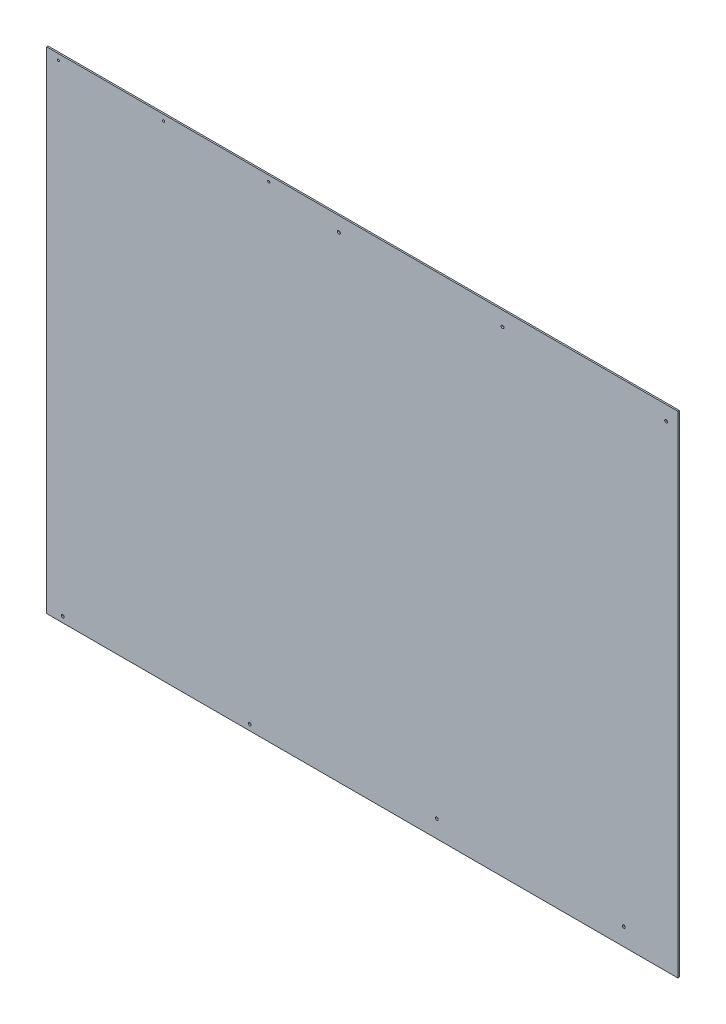
ISO-10303-21;
HEADER;
FILE_DESCRIPTION(('STEP AP214'),'2;1');
FILE_NAME('part.step','',(''),(''),'','','');
FILE_SCHEMA(('AUTOMOTIVE_DESIGN { 1 0 10303 214 1 1 1 1 }'));
ENDSEC;
DATA;
#1=APPLICATION_CONTEXT('core data for automotive mechanical design processes');
#2=APPLICATION_PROTOCOL_DEFINITION('international standard','automotive_design',2000,#1);
#3=PRODUCT_CONTEXT('',#1,'mechanical');
#4=PRODUCT('Part','Part','',(#3));
#5=PRODUCT_RELATED_PRODUCT_CATEGORY('part','',(#4));
#6=PRODUCT_DEFINITION_FORMATION('','',#4);
#7=PRODUCT_DEFINITION_CONTEXT('part definition',#1,'design');
#8=PRODUCT_DEFINITION('design','',#6,#7);
#9=PRODUCT_DEFINITION_SHAPE('','',#8);
#10=(LENGTH_UNIT() NAMED_UNIT(*) SI_UNIT(.MILLI.,.METRE.));
#11=(NAMED_UNIT(*) PLANE_ANGLE_UNIT() SI_UNIT($,.RADIAN.));
#12=(NAMED_UNIT(*) SI_UNIT($,.STERADIAN.) SOLID_ANGLE_UNIT());
#13=UNCERTAINTY_MEASURE_WITH_UNIT(LENGTH_MEASURE(1.E-05),#10,'distance_accuracy_value','');
#14=(GEOMETRIC_REPRESENTATION_CONTEXT(3) GLOBAL_UNCERTAINTY_ASSIGNED_CONTEXT((#13)) GLOBAL_UNIT_ASSIGNED_CONTEXT((#10,
#11,#12)) REPRESENTATION_CONTEXT('',''));
#15=CARTESIAN_POINT('',(0.,0.,0.));
#16=DIRECTION('',(0.,0.,1.));
#17=DIRECTION('',(1.,0.,0.));
#18=AXIS2_PLACEMENT_3D('',#15,#16,#17);
#19=CARTESIAN_POINT('',(0.,0.,-3.175));
#20=DIRECTION('',(0.,0.,1.));
#21=DIRECTION('',(1.,0.,0.));
#22=AXIS2_PLACEMENT_3D('',#19,#20,#21);
#23=PLANE('',#22);
#24=CARTESIAN_POINT('',(568.325,-495.3,-3.175));
#25=DIRECTION('',(0.,0.,1.));
#26=DIRECTION('',(1.,0.,0.));
#27=AXIS2_PLACEMENT_3D('',#24,#25,#26);
#28=CIRCLE('',#27,3.175);
#29=CARTESIAN_POINT('',(571.5,-495.3,-3.175));
#30=VERTEX_POINT('',#29);
#31=EDGE_CURVE('E108',#30,#30,#28,.T.);
#32=ORIENTED_EDGE('',*,*,#31,.T.);
#33=EDGE_LOOP('',(#32));
#34=FACE_BOUND('',#33,.T.);
#35=CARTESIAN_POINT('',(161.925,-495.3,-3.175));
#36=DIRECTION('',(0.,0.,1.));
#37=DIRECTION('',(1.,0.,0.));
#38=AXIS2_PLACEMENT_3D('',#35,#36,#37);
#39=CIRCLE('',#38,3.175);
#40=CARTESIAN_POINT('',(165.1,-495.3,-3.175));
#41=VERTEX_POINT('',#40);
#42=EDGE_CURVE('E112',#41,#41,#39,.T.);
#43=ORIENTED_EDGE('',*,*,#42,.T.);
#44=EDGE_LOOP('',(#43));
#45=FACE_BOUND('',#44,.T.);
#46=CARTESIAN_POINT('',(-50.8,501.65,-3.175));
#47=DIRECTION('',(0.,0.,1.));
#48=DIRECTION('',(1.,0.,0.));
#49=AXIS2_PLACEMENT_3D('',#46,#47,#48);
#50=CIRCLE('',#49,3.175);
#51=CARTESIAN_POINT('',(-47.625,501.65,-3.175));
#52=VERTEX_POINT('',#51);
#53=EDGE_CURVE('E115',#52,#52,#50,.T.);
#54=ORIENTED_EDGE('',*,*,#53,.T.);
#55=EDGE_LOOP('',(#54));
#56=FACE_BOUND('',#55,.T.);
#57=CARTESIAN_POINT('',(304.8,501.65,-3.175));
#58=DIRECTION('',(0.,0.,1.));
#59=DIRECTION('',(1.,0.,0.));
#60=AXIS2_PLACEMENT_3D('',#57,#58,#59);
#61=CIRCLE('',#60,3.175);
#62=CARTESIAN_POINT('',(307.975,501.65,-3.175));
#63=VERTEX_POINT('',#62);
#64=EDGE_CURVE('E118',#63,#63,#61,.T.);
#65=ORIENTED_EDGE('',*,*,#64,.T.);
#66=EDGE_LOOP('',(#65));
#67=FACE_BOUND('',#66,.T.);
#68=CARTESIAN_POINT('',(660.4,501.65,-3.175));
#69=DIRECTION('',(0.,0.,1.));
#70=DIRECTION('',(1.,0.,0.));
#71=AXIS2_PLACEMENT_3D('',#68,#69,#70);
#72=CIRCLE('',#71,3.175);
#73=CARTESIAN_POINT('',(663.575,501.65,-3.175));
#74=VERTEX_POINT('',#73);
#75=EDGE_CURVE('E121',#74,#74,#72,.T.);
#76=ORIENTED_EDGE('',*,*,#75,.T.);
#77=EDGE_LOOP('',(#76));
#78=FACE_BOUND('',#77,.T.);
#79=CARTESIAN_POINT('',(-244.475,-520.7,-3.175));
#80=DIRECTION('',(0.,0.,1.));
#81=DIRECTION('',(1.,0.,0.));
#82=AXIS2_PLACEMENT_3D('',#79,#80,#81);
#83=CIRCLE('',#82,3.175);
#84=CARTESIAN_POINT('',(-241.3,-520.7,-3.175));
#85=VERTEX_POINT('',#84);
#86=EDGE_CURVE('E124',#85,#85,#83,.T.);
#87=ORIENTED_EDGE('',*,*,#86,.T.);
#88=EDGE_LOOP('',(#87));
#89=FACE_BOUND('',#88,.T.);
#90=CARTESIAN_POINT('',(-650.875,-520.7,-3.175));
#91=DIRECTION('',(0.,0.,1.));
#92=DIRECTION('',(1.,0.,0.));
#93=AXIS2_PLACEMENT_3D('',#90,#91,#92);
#94=CIRCLE('',#93,3.175);
#95=CARTESIAN_POINT('',(-647.7,-520.7,-3.175));
#96=VERTEX_POINT('',#95);
#97=EDGE_CURVE('E127',#96,#96,#94,.T.);
#98=ORIENTED_EDGE('',*,*,#97,.T.);
#99=EDGE_LOOP('',(#98));
#100=FACE_BOUND('',#99,.T.);
#101=CARTESIAN_POINT('',(-203.2,520.7,-3.175));
#102=DIRECTION('',(0.,0.,1.));
#103=DIRECTION('',(1.,0.,0.));
#104=AXIS2_PLACEMENT_3D('',#101,#102,#103);
#105=CIRCLE('',#104,2.3876);
#106=CARTESIAN_POINT('',(-200.8124,520.7,-3.175));
#107=VERTEX_POINT('',#106);
#108=EDGE_CURVE('E130',#107,#107,#105,.T.);
#109=ORIENTED_EDGE('',*,*,#108,.T.);
#110=EDGE_LOOP('',(#109));
#111=FACE_BOUND('',#110,.T.);
#112=CARTESIAN_POINT('',(-431.8,520.7,-3.175));
#113=DIRECTION('',(0.,0.,1.));
#114=DIRECTION('',(1.,0.,0.));
#115=AXIS2_PLACEMENT_3D('',#112,#113,#114);
#116=CIRCLE('',#115,2.3876);
#117=CARTESIAN_POINT('',(-429.4124,520.7,-3.175));
#118=VERTEX_POINT('',#117);
#119=EDGE_CURVE('E132',#118,#118,#116,.T.);
#120=ORIENTED_EDGE('',*,*,#119,.T.);
#121=EDGE_LOOP('',(#120));
#122=FACE_BOUND('',#121,.T.);
#123=CARTESIAN_POINT('',(-660.4,520.7,-3.175));
#124=DIRECTION('',(0.,0.,1.));
#125=DIRECTION('',(1.,0.,0.));
#126=AXIS2_PLACEMENT_3D('',#123,#124,#125);
#127=CIRCLE('',#126,2.3876);
#128=CARTESIAN_POINT('',(-658.0124,520.7,-3.175));
#129=VERTEX_POINT('',#128);
#130=EDGE_CURVE('E20',#129,#129,#127,.T.);
#131=ORIENTED_EDGE('',*,*,#130,.T.);
#132=EDGE_LOOP('',(#131));
#133=FACE_BOUND('',#132,.T.);
#134=DIRECTION('',(1.,0.,0.));
#135=VECTOR('',#134,1.);
#136=CARTESIAN_POINT('',(685.8,533.4,-3.175));
#137=LINE('',#136,#135);
#138=CARTESIAN_POINT('',(685.8,533.4,-3.175));
#139=VERTEX_POINT('',#138);
#140=CARTESIAN_POINT('',(-685.8,533.4,-3.175));
#141=VERTEX_POINT('',#140);
#142=EDGE_CURVE('E55',#139,#141,#137,.F.);
#143=ORIENTED_EDGE('',*,*,#142,.F.);
#144=DIRECTION('',(0.,1.,0.));
#145=VECTOR('',#144,1.);
#146=CARTESIAN_POINT('',(685.8,-533.4,-3.175));
#147=LINE('',#146,#145);
#148=CARTESIAN_POINT('',(685.8,-533.4,-3.175));
#149=VERTEX_POINT('',#148);
#150=EDGE_CURVE('E60',#149,#139,#147,.T.);
#151=ORIENTED_EDGE('',*,*,#150,.F.);
#152=DIRECTION('',(1.,0.,0.));
#153=VECTOR('',#152,1.);
#154=CARTESIAN_POINT('',(-685.8,-533.4,-3.175));
#155=LINE('',#154,#153);
#156=CARTESIAN_POINT('',(-685.8,-533.4,-3.175));
#157=VERTEX_POINT('',#156);
#158=EDGE_CURVE('E139',#157,#149,#155,.T.);
#159=ORIENTED_EDGE('',*,*,#158,.F.);
#160=DIRECTION('',(0.,1.,0.));
#161=VECTOR('',#160,1.);
#162=CARTESIAN_POINT('',(-685.8,533.4,-3.175));
#163=LINE('',#162,#161);
#164=EDGE_CURVE('E70',#141,#157,#163,.F.);
#165=ORIENTED_EDGE('',*,*,#164,.F.);
#166=EDGE_LOOP('',(#143,#151,#159,#165));
#167=FACE_BOUND('',#166,.T.);
#168=ADVANCED_FACE('F17',(#34,#45,#56,#67,#78,#89,#100,#111,#122,#133,#167),#23,.F.);
#169=CARTESIAN_POINT('',(685.8,-533.4,0.));
#170=DIRECTION('',(1.,0.,0.));
#171=DIRECTION('',(0.,0.,-1.));
#172=AXIS2_PLACEMENT_3D('',#169,#170,#171);
#173=PLANE('',#172);
#174=DIRECTION('',(0.,0.,1.));
#175=VECTOR('',#174,1.);
#176=CARTESIAN_POINT('',(685.8,533.4,0.));
#177=LINE('',#176,#175);
#178=CARTESIAN_POINT('',(685.8,533.4,0.));
#179=VERTEX_POINT('',#178);
#180=EDGE_CURVE('E62',#179,#139,#177,.F.);
#181=ORIENTED_EDGE('',*,*,#180,.F.);
#182=DIRECTION('',(0.,1.,0.));
#183=VECTOR('',#182,1.);
#184=CARTESIAN_POINT('',(685.8,0.,0.));
#185=LINE('',#184,#183);
#186=CARTESIAN_POINT('',(685.8,-533.4,0.));
#187=VERTEX_POINT('',#186);
#188=EDGE_CURVE('E111',#187,#179,#185,.T.);
#189=ORIENTED_EDGE('',*,*,#188,.F.);
#190=DIRECTION('',(0.,0.,-1.));
#191=VECTOR('',#190,1.);
#192=CARTESIAN_POINT('',(685.8,-533.4,0.));
#193=LINE('',#192,#191);
#194=EDGE_CURVE('E65',#149,#187,#193,.F.);
#195=ORIENTED_EDGE('',*,*,#194,.F.);
#196=ORIENTED_EDGE('',*,*,#150,.T.);
#197=EDGE_LOOP('',(#181,#189,#195,#196));
#198=FACE_BOUND('',#197,.T.);
#199=ADVANCED_FACE('F61',(#198),#173,.T.);
#200=CARTESIAN_POINT('',(685.8,533.4,0.));
#201=DIRECTION('',(0.,1.,0.));
#202=DIRECTION('',(0.,0.,1.));
#203=AXIS2_PLACEMENT_3D('',#200,#201,#202);
#204=PLANE('',#203);
#205=DIRECTION('',(0.,0.,1.));
#206=VECTOR('',#205,1.);
#207=CARTESIAN_POINT('',(-685.8,533.4,0.));
#208=LINE('',#207,#206);
#209=CARTESIAN_POINT('',(-685.8,533.4,0.));
#210=VERTEX_POINT('',#209);
#211=EDGE_CURVE('E72',#210,#141,#208,.F.);
#212=ORIENTED_EDGE('',*,*,#211,.F.);
#213=DIRECTION('',(1.,0.,0.));
#214=VECTOR('',#213,1.);
#215=CARTESIAN_POINT('',(0.,533.4,0.));
#216=LINE('',#215,#214);
#217=EDGE_CURVE('E76',#179,#210,#216,.F.);
#218=ORIENTED_EDGE('',*,*,#217,.F.);
#219=ORIENTED_EDGE('',*,*,#180,.T.);
#220=ORIENTED_EDGE('',*,*,#142,.T.);
#221=EDGE_LOOP('',(#212,#218,#219,#220));
#222=FACE_BOUND('',#221,.T.);
#223=ADVANCED_FACE('F74',(#222),#204,.T.);
#224=CARTESIAN_POINT('',(-685.8,533.4,0.));
#225=DIRECTION('',(-1.,0.,0.));
#226=DIRECTION('',(0.,0.,1.));
#227=AXIS2_PLACEMENT_3D('',#224,#225,#226);
#228=PLANE('',#227);
#229=DIRECTION('',(0.,0.,-1.));
#230=VECTOR('',#229,1.);
#231=CARTESIAN_POINT('',(-685.8,-533.4,0.));
#232=LINE('',#231,#230);
#233=CARTESIAN_POINT('',(-685.8,-533.4,0.));
#234=VERTEX_POINT('',#233);
#235=EDGE_CURVE('E35',#234,#157,#232,.T.);
#236=ORIENTED_EDGE('',*,*,#235,.F.);
#237=DIRECTION('',(0.,1.,0.));
#238=VECTOR('',#237,1.);
#239=CARTESIAN_POINT('',(-685.8,0.,0.));
#240=LINE('',#239,#238);
#241=EDGE_CURVE('E150',#210,#234,#240,.F.);
#242=ORIENTED_EDGE('',*,*,#241,.F.);
#243=ORIENTED_EDGE('',*,*,#211,.T.);
#244=ORIENTED_EDGE('',*,*,#164,.T.);
#245=EDGE_LOOP('',(#236,#242,#243,#244));
#246=FACE_BOUND('',#245,.T.);
#247=ADVANCED_FACE('F148',(#246),#228,.T.);
#248=CARTESIAN_POINT('',(-685.8,-533.4,0.));
#249=DIRECTION('',(0.,-1.,0.));
#250=DIRECTION('',(0.,0.,-1.));
#251=AXIS2_PLACEMENT_3D('',#248,#249,#250);
#252=PLANE('',#251);
#253=ORIENTED_EDGE('',*,*,#194,.T.);
#254=DIRECTION('',(1.,0.,0.));
#255=VECTOR('',#254,1.);
#256=CARTESIAN_POINT('',(0.,-533.4,0.));
#257=LINE('',#256,#255);
#258=EDGE_CURVE('E107',#234,#187,#257,.T.);
#259=ORIENTED_EDGE('',*,*,#258,.F.);
#260=ORIENTED_EDGE('',*,*,#235,.T.);
#261=ORIENTED_EDGE('',*,*,#158,.T.);
#262=EDGE_LOOP('',(#253,#259,#260,#261));
#263=FACE_BOUND('',#262,.T.);
#264=ADVANCED_FACE('F155',(#263),#252,.T.);
#265=CARTESIAN_POINT('',(-660.4,520.7,0.));
#266=DIRECTION('',(0.,0.,1.));
#267=DIRECTION('',(1.,0.,0.));
#268=AXIS2_PLACEMENT_3D('',#265,#266,#267);
#269=CYLINDRICAL_SURFACE('',#268,2.3876);
#270=ORIENTED_EDGE('',*,*,#130,.F.);
#271=EDGE_LOOP('',(#270));
#272=FACE_BOUND('',#271,.T.);
#273=CARTESIAN_POINT('',(-660.4,520.7,0.));
#274=DIRECTION('',(0.,0.,1.));
#275=DIRECTION('',(1.,0.,0.));
#276=AXIS2_PLACEMENT_3D('',#273,#274,#275);
#277=CIRCLE('',#276,2.3876);
#278=CARTESIAN_POINT('',(-658.0124,520.7,0.));
#279=VERTEX_POINT('',#278);
#280=EDGE_CURVE('E104',#279,#279,#277,.F.);
#281=ORIENTED_EDGE('',*,*,#280,.F.);
#282=EDGE_LOOP('',(#281));
#283=FACE_BOUND('',#282,.T.);
#284=ADVANCED_FACE('F157',(#272,#283),#269,.F.);
#285=CARTESIAN_POINT('',(-431.8,520.7,0.));
#286=DIRECTION('',(0.,0.,1.));
#287=DIRECTION('',(1.,0.,0.));
#288=AXIS2_PLACEMENT_3D('',#285,#286,#287);
#289=CYLINDRICAL_SURFACE('',#288,2.3876);
#290=ORIENTED_EDGE('',*,*,#119,.F.);
#291=EDGE_LOOP('',(#290));
#292=FACE_BOUND('',#291,.T.);
#293=CARTESIAN_POINT('',(-431.8,520.7,0.));
#294=DIRECTION('',(0.,0.,1.));
#295=DIRECTION('',(1.,0.,0.));
#296=AXIS2_PLACEMENT_3D('',#293,#294,#295);
#297=CIRCLE('',#296,2.3876);
#298=CARTESIAN_POINT('',(-429.4124,520.7,0.));
#299=VERTEX_POINT('',#298);
#300=EDGE_CURVE('E101',#299,#299,#297,.F.);
#301=ORIENTED_EDGE('',*,*,#300,.F.);
#302=EDGE_LOOP('',(#301));
#303=FACE_BOUND('',#302,.T.);
#304=ADVANCED_FACE('F164',(#292,#303),#289,.F.);
#305=CARTESIAN_POINT('',(-203.2,520.7,0.));
#306=DIRECTION('',(0.,0.,1.));
#307=DIRECTION('',(1.,0.,0.));
#308=AXIS2_PLACEMENT_3D('',#305,#306,#307);
#309=CYLINDRICAL_SURFACE('',#308,2.3876);
#310=ORIENTED_EDGE('',*,*,#108,.F.);
#311=EDGE_LOOP('',(#310));
#312=FACE_BOUND('',#311,.T.);
#313=CARTESIAN_POINT('',(-203.2,520.7,0.));
#314=DIRECTION('',(0.,0.,1.));
#315=DIRECTION('',(1.,0.,0.));
#316=AXIS2_PLACEMENT_3D('',#313,#314,#315);
#317=CIRCLE('',#316,2.3876);
#318=CARTESIAN_POINT('',(-200.8124,520.7,0.));
#319=VERTEX_POINT('',#318);
#320=EDGE_CURVE('E98',#319,#319,#317,.F.);
#321=ORIENTED_EDGE('',*,*,#320,.F.);
#322=EDGE_LOOP('',(#321));
#323=FACE_BOUND('',#322,.T.);
#324=ADVANCED_FACE('F202',(#312,#323),#309,.F.);
#325=CARTESIAN_POINT('',(-650.875,-520.7,0.));
#326=DIRECTION('',(0.,0.,1.));
#327=DIRECTION('',(1.,0.,0.));
#328=AXIS2_PLACEMENT_3D('',#325,#326,#327);
#329=CYLINDRICAL_SURFACE('',#328,3.175);
#330=ORIENTED_EDGE('',*,*,#97,.F.);
#331=EDGE_LOOP('',(#330));
#332=FACE_BOUND('',#331,.T.);
#333=CARTESIAN_POINT('',(-650.875,-520.7,0.));
#334=DIRECTION('',(0.,0.,1.));
#335=DIRECTION('',(1.,0.,0.));
#336=AXIS2_PLACEMENT_3D('',#333,#334,#335);
#337=CIRCLE('',#336,3.175);
#338=CARTESIAN_POINT('',(-647.7,-520.7,0.));
#339=VERTEX_POINT('',#338);
#340=EDGE_CURVE('E95',#339,#339,#337,.F.);
#341=ORIENTED_EDGE('',*,*,#340,.F.);
#342=EDGE_LOOP('',(#341));
#343=FACE_BOUND('',#342,.T.);
#344=ADVANCED_FACE('F198',(#332,#343),#329,.F.);
#345=CARTESIAN_POINT('',(-244.475,-520.7,0.));
#346=DIRECTION('',(0.,0.,1.));
#347=DIRECTION('',(1.,0.,0.));
#348=AXIS2_PLACEMENT_3D('',#345,#346,#347);
#349=CYLINDRICAL_SURFACE('',#348,3.175);
#350=ORIENTED_EDGE('',*,*,#86,.F.);
#351=EDGE_LOOP('',(#350));
#352=FACE_BOUND('',#351,.T.);
#353=CARTESIAN_POINT('',(-244.475,-520.7,0.));
#354=DIRECTION('',(0.,0.,1.));
#355=DIRECTION('',(1.,0.,0.));
#356=AXIS2_PLACEMENT_3D('',#353,#354,#355);
#357=CIRCLE('',#356,3.175);
#358=CARTESIAN_POINT('',(-241.3,-520.7,0.));
#359=VERTEX_POINT('',#358);
#360=EDGE_CURVE('E92',#359,#359,#357,.F.);
#361=ORIENTED_EDGE('',*,*,#360,.F.);
#362=EDGE_LOOP('',(#361));
#363=FACE_BOUND('',#362,.T.);
#364=ADVANCED_FACE('F194',(#352,#363),#349,.F.);
#365=CARTESIAN_POINT('',(660.4,501.65,0.));
#366=DIRECTION('',(0.,0.,1.));
#367=DIRECTION('',(1.,0.,0.));
#368=AXIS2_PLACEMENT_3D('',#365,#366,#367);
#369=CYLINDRICAL_SURFACE('',#368,3.175);
#370=ORIENTED_EDGE('',*,*,#75,.F.);
#371=EDGE_LOOP('',(#370));
#372=FACE_BOUND('',#371,.T.);
#373=CARTESIAN_POINT('',(660.4,501.65,0.));
#374=DIRECTION('',(0.,0.,1.));
#375=DIRECTION('',(1.,0.,0.));
#376=AXIS2_PLACEMENT_3D('',#373,#374,#375);
#377=CIRCLE('',#376,3.175);
#378=CARTESIAN_POINT('',(663.575,501.65,0.));
#379=VERTEX_POINT('',#378);
#380=EDGE_CURVE('E89',#379,#379,#377,.F.);
#381=ORIENTED_EDGE('',*,*,#380,.F.);
#382=EDGE_LOOP('',(#381));
#383=FACE_BOUND('',#382,.T.);
#384=ADVANCED_FACE('F190',(#372,#383),#369,.F.);
#385=CARTESIAN_POINT('',(304.8,501.65,0.));
#386=DIRECTION('',(0.,0.,1.));
#387=DIRECTION('',(1.,0.,0.));
#388=AXIS2_PLACEMENT_3D('',#385,#386,#387);
#389=CYLINDRICAL_SURFACE('',#388,3.175);
#390=ORIENTED_EDGE('',*,*,#64,.F.);
#391=EDGE_LOOP('',(#390));
#392=FACE_BOUND('',#391,.T.);
#393=CARTESIAN_POINT('',(304.8,501.65,0.));
#394=DIRECTION('',(0.,0.,1.));
#395=DIRECTION('',(1.,0.,0.));
#396=AXIS2_PLACEMENT_3D('',#393,#394,#395);
#397=CIRCLE('',#396,3.175);
#398=CARTESIAN_POINT('',(307.975,501.65,0.));
#399=VERTEX_POINT('',#398);
#400=EDGE_CURVE('E86',#399,#399,#397,.F.);
#401=ORIENTED_EDGE('',*,*,#400,.F.);
#402=EDGE_LOOP('',(#401));
#403=FACE_BOUND('',#402,.T.);
#404=ADVANCED_FACE('F186',(#392,#403),#389,.F.);
#405=CARTESIAN_POINT('',(-50.8,501.65,0.));
#406=DIRECTION('',(0.,0.,1.));
#407=DIRECTION('',(1.,0.,0.));
#408=AXIS2_PLACEMENT_3D('',#405,#406,#407);
#409=CYLINDRICAL_SURFACE('',#408,3.175);
#410=ORIENTED_EDGE('',*,*,#53,.F.);
#411=EDGE_LOOP('',(#410));
#412=FACE_BOUND('',#411,.T.);
#413=CARTESIAN_POINT('',(-50.8,501.65,0.));
#414=DIRECTION('',(0.,0.,1.));
#415=DIRECTION('',(1.,0.,0.));
#416=AXIS2_PLACEMENT_3D('',#413,#414,#415);
#417=CIRCLE('',#416,3.175);
#418=CARTESIAN_POINT('',(-47.625,501.65,0.));
#419=VERTEX_POINT('',#418);
#420=EDGE_CURVE('E83',#419,#419,#417,.F.);
#421=ORIENTED_EDGE('',*,*,#420,.F.);
#422=EDGE_LOOP('',(#421));
#423=FACE_BOUND('',#422,.T.);
#424=ADVANCED_FACE('F182',(#412,#423),#409,.F.);
#425=CARTESIAN_POINT('',(161.925,-495.3,0.));
#426=DIRECTION('',(0.,0.,1.));
#427=DIRECTION('',(1.,0.,0.));
#428=AXIS2_PLACEMENT_3D('',#425,#426,#427);
#429=CYLINDRICAL_SURFACE('',#428,3.175);
#430=ORIENTED_EDGE('',*,*,#42,.F.);
#431=EDGE_LOOP('',(#430));
#432=FACE_BOUND('',#431,.T.);
#433=CARTESIAN_POINT('',(161.925,-495.3,0.));
#434=DIRECTION('',(0.,0.,1.));
#435=DIRECTION('',(1.,0.,0.));
#436=AXIS2_PLACEMENT_3D('',#433,#434,#435);
#437=CIRCLE('',#436,3.175);
#438=CARTESIAN_POINT('',(165.1,-495.3,0.));
#439=VERTEX_POINT('',#438);
#440=EDGE_CURVE('E26',#439,#439,#437,.F.);
#441=ORIENTED_EDGE('',*,*,#440,.F.);
#442=EDGE_LOOP('',(#441));
#443=FACE_BOUND('',#442,.T.);
#444=ADVANCED_FACE('F175',(#432,#443),#429,.F.);
#445=CARTESIAN_POINT('',(568.325,-495.3,0.));
#446=DIRECTION('',(0.,0.,1.));
#447=DIRECTION('',(1.,0.,0.));
#448=AXIS2_PLACEMENT_3D('',#445,#446,#447);
#449=CYLINDRICAL_SURFACE('',#448,3.175);
#450=ORIENTED_EDGE('',*,*,#31,.F.);
#451=EDGE_LOOP('',(#450));
#452=FACE_BOUND('',#451,.T.);
#453=CARTESIAN_POINT('',(568.325,-495.3,0.));
#454=DIRECTION('',(0.,0.,1.));
#455=DIRECTION('',(1.,0.,0.));
#456=AXIS2_PLACEMENT_3D('',#453,#454,#455);
#457=CIRCLE('',#456,3.175);
#458=CARTESIAN_POINT('',(571.5,-495.3,0.));
#459=VERTEX_POINT('',#458);
#460=EDGE_CURVE('E11',#459,#459,#457,.F.);
#461=ORIENTED_EDGE('',*,*,#460,.F.);
#462=EDGE_LOOP('',(#461));
#463=FACE_BOUND('',#462,.T.);
#464=ADVANCED_FACE('F169',(#452,#463),#449,.F.);
#465=CARTESIAN_POINT('',(0.,0.,0.));
#466=DIRECTION('',(0.,0.,1.));
#467=DIRECTION('',(1.,0.,0.));
#468=AXIS2_PLACEMENT_3D('',#465,#466,#467);
#469=PLANE('',#468);
#470=ORIENTED_EDGE('',*,*,#460,.T.);
#471=EDGE_LOOP('',(#470));
#472=FACE_BOUND('',#471,.T.);
#473=ORIENTED_EDGE('',*,*,#440,.T.);
#474=EDGE_LOOP('',(#473));
#475=FACE_BOUND('',#474,.T.);
#476=ORIENTED_EDGE('',*,*,#420,.T.);
#477=EDGE_LOOP('',(#476));
#478=FACE_BOUND('',#477,.T.);
#479=ORIENTED_EDGE('',*,*,#400,.T.);
#480=EDGE_LOOP('',(#479));
#481=FACE_BOUND('',#480,.T.);
#482=ORIENTED_EDGE('',*,*,#380,.T.);
#483=EDGE_LOOP('',(#482));
#484=FACE_BOUND('',#483,.T.);
#485=ORIENTED_EDGE('',*,*,#360,.T.);
#486=EDGE_LOOP('',(#485));
#487=FACE_BOUND('',#486,.T.);
#488=ORIENTED_EDGE('',*,*,#340,.T.);
#489=EDGE_LOOP('',(#488));
#490=FACE_BOUND('',#489,.T.);
#491=ORIENTED_EDGE('',*,*,#320,.T.);
#492=EDGE_LOOP('',(#491));
#493=FACE_BOUND('',#492,.T.);
#494=ORIENTED_EDGE('',*,*,#300,.T.);
#495=EDGE_LOOP('',(#494));
#496=FACE_BOUND('',#495,.T.);
#497=ORIENTED_EDGE('',*,*,#280,.T.);
#498=EDGE_LOOP('',(#497));
#499=FACE_BOUND('',#498,.T.);
#500=ORIENTED_EDGE('',*,*,#241,.T.);
#501=ORIENTED_EDGE('',*,*,#258,.T.);
#502=ORIENTED_EDGE('',*,*,#188,.T.);
#503=ORIENTED_EDGE('',*,*,#217,.T.);
#504=EDGE_LOOP('',(#500,#501,#502,#503));
#505=FACE_BOUND('',#504,.T.);
#506=ADVANCED_FACE('F153',(#472,#475,#478,#481,#484,#487,#490,#493,#496,#499,#505),#469,.T.);
#507=CLOSED_SHELL('',(#168,#199,#223,#247,#264,#284,#304,#324,#344,#364,#384,#404,#424,#444,
#464,#506));
#508=MANIFOLD_SOLID_BREP('B1',#507);
#509=ADVANCED_BREP_SHAPE_REPRESENTATION('',(#18,#508),#14);
#510=SHAPE_DEFINITION_REPRESENTATION(#9,#509);
ENDSEC;
END-ISO-10303-21;
